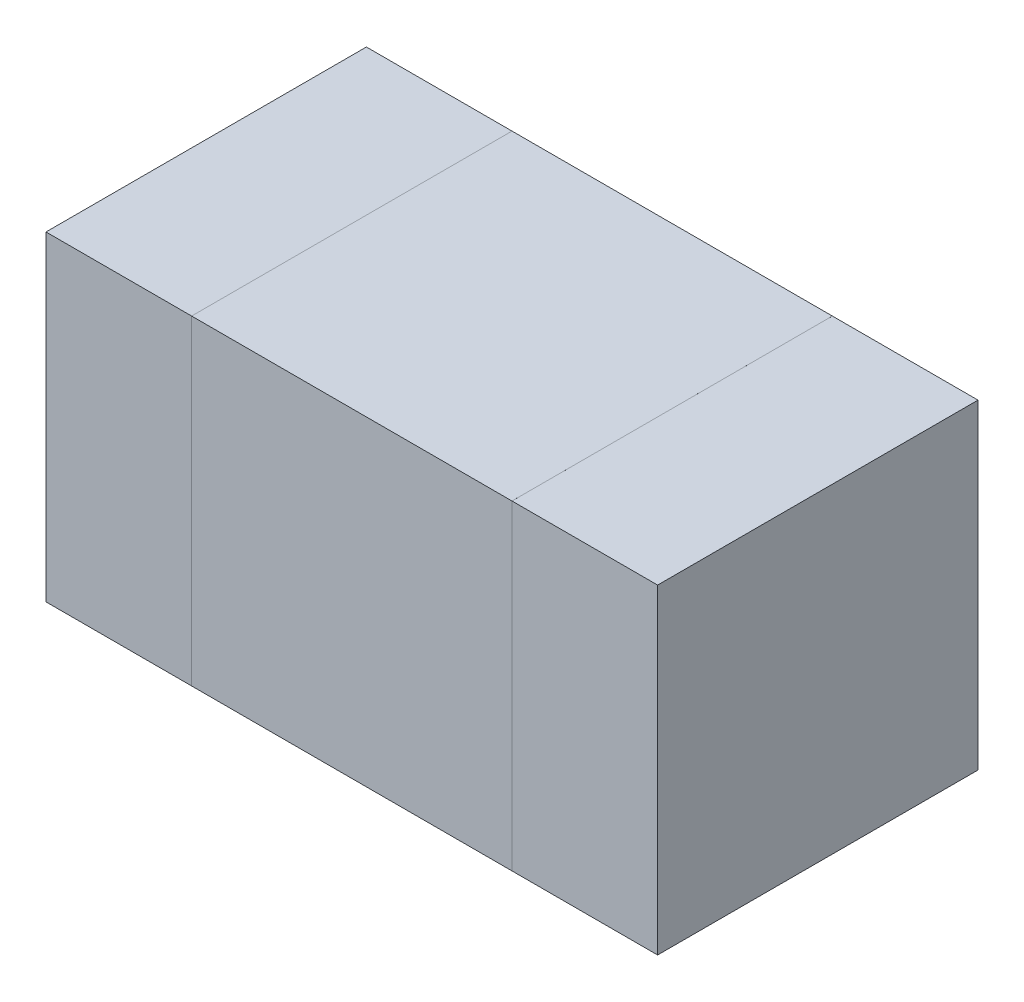
ISO-10303-21;
HEADER;
FILE_DESCRIPTION(('STEP AP214'),'2;1');
FILE_NAME('part.step','',(''),(''),'','','');
FILE_SCHEMA(('AUTOMOTIVE_DESIGN { 1 0 10303 214 1 1 1 1 }'));
ENDSEC;
DATA;
#1=APPLICATION_CONTEXT('core data for automotive mechanical design processes');
#2=APPLICATION_PROTOCOL_DEFINITION('international standard','automotive_design',2000,#1);
#3=PRODUCT_CONTEXT('',#1,'mechanical');
#4=PRODUCT('Part','Part','',(#3));
#5=PRODUCT_RELATED_PRODUCT_CATEGORY('part','',(#4));
#6=PRODUCT_DEFINITION_FORMATION('','',#4);
#7=PRODUCT_DEFINITION_CONTEXT('part definition',#1,'design');
#8=PRODUCT_DEFINITION('design','',#6,#7);
#9=PRODUCT_DEFINITION_SHAPE('','',#8);
#10=(LENGTH_UNIT() NAMED_UNIT(*) SI_UNIT(.MILLI.,.METRE.));
#11=(NAMED_UNIT(*) PLANE_ANGLE_UNIT() SI_UNIT($,.RADIAN.));
#12=(NAMED_UNIT(*) SI_UNIT($,.STERADIAN.) SOLID_ANGLE_UNIT());
#13=UNCERTAINTY_MEASURE_WITH_UNIT(LENGTH_MEASURE(1.E-05),#10,'distance_accuracy_value','');
#14=(GEOMETRIC_REPRESENTATION_CONTEXT(3) GLOBAL_UNCERTAINTY_ASSIGNED_CONTEXT((#13)) GLOBAL_UNIT_ASSIGNED_CONTEXT((#10,
#11,#12)) REPRESENTATION_CONTEXT('',''));
#15=CARTESIAN_POINT('',(0.,0.,0.));
#16=DIRECTION('',(0.,0.,1.));
#17=DIRECTION('',(1.,0.,0.));
#18=AXIS2_PLACEMENT_3D('',#15,#16,#17);
#19=CARTESIAN_POINT('',(1.63999285418,9.184994368437,0.32999934));
#20=DIRECTION('',(0.,0.,-1.));
#21=DIRECTION('',(0.,-1.,0.));
#22=AXIS2_PLACEMENT_3D('',#19,#20,#21);
#23=PLANE('',#22);
#24=DIRECTION('',(0.,1.,0.));
#25=VECTOR('',#24,1.);
#26=CARTESIAN_POINT('',(1.63999285418,9.184994368437,0.32999934));
#27=LINE('',#26,#25);
#28=CARTESIAN_POINT('',(1.63999285418,9.184994368437,0.32999934));
#29=VERTEX_POINT('',#28);
#30=CARTESIAN_POINT('',(1.63999285418,9.514996248437,0.32999934));
#31=VERTEX_POINT('',#30);
#32=EDGE_CURVE('P0_E98',#29,#31,#27,.T.);
#33=ORIENTED_EDGE('',*,*,#32,.T.);
#34=DIRECTION('',(-1.,0.,0.));
#35=VECTOR('',#34,1.);
#36=CARTESIAN_POINT('',(1.63999285418,9.514996248437,0.32999934));
#37=LINE('',#36,#35);
#38=CARTESIAN_POINT('',(1.30999351418,9.514996248437,0.32999934));
#39=VERTEX_POINT('',#38);
#40=EDGE_CURVE('P0_E78',#31,#39,#37,.T.);
#41=ORIENTED_EDGE('',*,*,#40,.T.);
#42=DIRECTION('',(0.,-1.,0.));
#43=VECTOR('',#42,1.);
#44=CARTESIAN_POINT('',(1.30999351418,9.514996248437,0.32999934));
#45=LINE('',#44,#43);
#46=CARTESIAN_POINT('',(1.30999351418,9.184994368437,0.32999934));
#47=VERTEX_POINT('',#46);
#48=EDGE_CURVE('P0_E83',#39,#47,#45,.T.);
#49=ORIENTED_EDGE('',*,*,#48,.T.);
#50=DIRECTION('',(1.,0.,0.));
#51=VECTOR('',#50,1.);
#52=CARTESIAN_POINT('',(1.30999351418,9.184994368437,0.32999934));
#53=LINE('',#52,#51);
#54=EDGE_CURVE('P0_E11',#47,#29,#53,.T.);
#55=ORIENTED_EDGE('',*,*,#54,.T.);
#56=EDGE_LOOP('',(#33,#41,#49,#55));
#57=FACE_BOUND('',#56,.T.);
#58=ADVANCED_FACE('P0_F17',(#57),#23,.F.);
#59=CARTESIAN_POINT('',(1.63999285418,9.184994368437,0.));
#60=DIRECTION('',(0.,0.,-1.));
#61=DIRECTION('',(0.,-1.,0.));
#62=AXIS2_PLACEMENT_3D('',#59,#60,#61);
#63=PLANE('',#62);
#64=DIRECTION('',(1.,0.,0.));
#65=VECTOR('',#64,1.);
#66=CARTESIAN_POINT('',(1.30999351418,9.184994368437,0.));
#67=LINE('',#66,#65);
#68=CARTESIAN_POINT('',(1.30999351418,9.184994368437,0.));
#69=VERTEX_POINT('',#68);
#70=CARTESIAN_POINT('',(1.63999285418,9.184994368437,0.));
#71=VERTEX_POINT('',#70);
#72=EDGE_CURVE('P0_E20',#69,#71,#67,.T.);
#73=ORIENTED_EDGE('',*,*,#72,.F.);
#74=DIRECTION('',(0.,-1.,0.));
#75=VECTOR('',#74,1.);
#76=CARTESIAN_POINT('',(1.30999351418,9.514996248437,0.));
#77=LINE('',#76,#75);
#78=CARTESIAN_POINT('',(1.30999351418,9.514996248437,0.));
#79=VERTEX_POINT('',#78);
#80=EDGE_CURVE('P0_E68',#79,#69,#77,.T.);
#81=ORIENTED_EDGE('',*,*,#80,.F.);
#82=DIRECTION('',(-1.,0.,0.));
#83=VECTOR('',#82,1.);
#84=CARTESIAN_POINT('',(1.63999285418,9.514996248437,0.));
#85=LINE('',#84,#83);
#86=CARTESIAN_POINT('',(1.63999285418,9.514996248437,0.));
#87=VERTEX_POINT('',#86);
#88=EDGE_CURVE('P0_E72',#87,#79,#85,.T.);
#89=ORIENTED_EDGE('',*,*,#88,.F.);
#90=DIRECTION('',(0.,1.,0.));
#91=VECTOR('',#90,1.);
#92=CARTESIAN_POINT('',(1.63999285418,9.184994368437,0.));
#93=LINE('',#92,#91);
#94=EDGE_CURVE('P0_E115',#71,#87,#93,.T.);
#95=ORIENTED_EDGE('',*,*,#94,.F.);
#96=EDGE_LOOP('',(#73,#81,#89,#95));
#97=FACE_BOUND('',#96,.T.);
#98=ADVANCED_FACE('P0_F70',(#97),#63,.T.);
#99=CARTESIAN_POINT('',(1.30999351418,9.184994368437,0.));
#100=DIRECTION('',(0.,1.,0.));
#101=DIRECTION('',(1.,0.,0.));
#102=AXIS2_PLACEMENT_3D('',#99,#100,#101);
#103=PLANE('',#102);
#104=ORIENTED_EDGE('',*,*,#72,.T.);
#105=DIRECTION('',(0.,0.,1.));
#106=VECTOR('',#105,1.);
#107=CARTESIAN_POINT('',(1.63999285418,9.184994368437,0.));
#108=LINE('',#107,#106);
#109=EDGE_CURVE('P0_E93',#71,#29,#108,.T.);
#110=ORIENTED_EDGE('',*,*,#109,.T.);
#111=ORIENTED_EDGE('',*,*,#54,.F.);
#112=DIRECTION('',(0.,0.,1.));
#113=VECTOR('',#112,1.);
#114=CARTESIAN_POINT('',(1.30999351418,9.184994368437,0.));
#115=LINE('',#114,#113);
#116=EDGE_CURVE('P0_E77',#69,#47,#115,.T.);
#117=ORIENTED_EDGE('',*,*,#116,.F.);
#118=EDGE_LOOP('',(#104,#110,#111,#117));
#119=FACE_BOUND('',#118,.T.);
#120=ADVANCED_FACE('P0_F111',(#119),#103,.F.);
#121=CARTESIAN_POINT('',(1.30999351418,9.514996248437,0.));
#122=DIRECTION('',(1.,0.,0.));
#123=DIRECTION('',(0.,1.,0.));
#124=AXIS2_PLACEMENT_3D('',#121,#122,#123);
#125=PLANE('',#124);
#126=ORIENTED_EDGE('',*,*,#80,.T.);
#127=ORIENTED_EDGE('',*,*,#116,.T.);
#128=ORIENTED_EDGE('',*,*,#48,.F.);
#129=DIRECTION('',(0.,0.,1.));
#130=VECTOR('',#129,1.);
#131=CARTESIAN_POINT('',(1.30999351418,9.514996248437,0.));
#132=LINE('',#131,#130);
#133=EDGE_CURVE('P0_E81',#79,#39,#132,.T.);
#134=ORIENTED_EDGE('',*,*,#133,.F.);
#135=EDGE_LOOP('',(#126,#127,#128,#134));
#136=FACE_BOUND('',#135,.T.);
#137=ADVANCED_FACE('P0_F82',(#136),#125,.F.);
#138=CARTESIAN_POINT('',(1.63999285418,9.514996248437,0.));
#139=DIRECTION('',(0.,-1.,0.));
#140=DIRECTION('',(0.,0.,-1.));
#141=AXIS2_PLACEMENT_3D('',#138,#139,#140);
#142=PLANE('',#141);
#143=ORIENTED_EDGE('',*,*,#88,.T.);
#144=ORIENTED_EDGE('',*,*,#133,.T.);
#145=ORIENTED_EDGE('',*,*,#40,.F.);
#146=DIRECTION('',(0.,0.,1.));
#147=VECTOR('',#146,1.);
#148=CARTESIAN_POINT('',(1.63999285418,9.514996248437,0.));
#149=LINE('',#148,#147);
#150=EDGE_CURVE('P0_E90',#87,#31,#149,.T.);
#151=ORIENTED_EDGE('',*,*,#150,.F.);
#152=EDGE_LOOP('',(#143,#144,#145,#151));
#153=FACE_BOUND('',#152,.T.);
#154=ADVANCED_FACE('P0_F88',(#153),#142,.F.);
#155=CARTESIAN_POINT('',(1.63999285418,9.184994368437,0.));
#156=DIRECTION('',(-1.,0.,0.));
#157=DIRECTION('',(0.,0.,1.));
#158=AXIS2_PLACEMENT_3D('',#155,#156,#157);
#159=PLANE('',#158);
#160=ORIENTED_EDGE('',*,*,#94,.T.);
#161=ORIENTED_EDGE('',*,*,#150,.T.);
#162=ORIENTED_EDGE('',*,*,#32,.F.);
#163=ORIENTED_EDGE('',*,*,#109,.F.);
#164=EDGE_LOOP('',(#160,#161,#162,#163));
#165=FACE_BOUND('',#164,.T.);
#166=ADVANCED_FACE('P0_F114',(#165),#159,.F.);
#167=CLOSED_SHELL('',(#58,#98,#120,#137,#154,#166));
#168=MANIFOLD_SOLID_BREP('P0_B1',#167);
#169=CARTESIAN_POINT('',(1.789998527344,9.184994368437,0.32999934));
#170=DIRECTION('',(0.,0.,-1.));
#171=DIRECTION('',(0.,-1.,0.));
#172=AXIS2_PLACEMENT_3D('',#169,#170,#171);
#173=PLANE('',#172);
#174=DIRECTION('',(0.,1.,0.));
#175=VECTOR('',#174,1.);
#176=CARTESIAN_POINT('',(1.789998527344,9.184994368437,0.32999934));
#177=LINE('',#176,#175);
#178=CARTESIAN_POINT('',(1.789998527344,9.184994368437,0.32999934));
#179=VERTEX_POINT('',#178);
#180=CARTESIAN_POINT('',(1.789998527344,9.514996248437,0.32999934));
#181=VERTEX_POINT('',#180);
#182=EDGE_CURVE('P1_E81',#179,#181,#177,.T.);
#183=ORIENTED_EDGE('',*,*,#182,.T.);
#184=DIRECTION('',(-1.,0.,0.));
#185=VECTOR('',#184,1.);
#186=CARTESIAN_POINT('',(1.789998527344,9.514996248437,0.32999934));
#187=LINE('',#186,#185);
#188=CARTESIAN_POINT('',(1.639996287344,9.514996248437,0.32999934));
#189=VERTEX_POINT('',#188);
#190=EDGE_CURVE('P1_E102',#181,#189,#187,.T.);
#191=ORIENTED_EDGE('',*,*,#190,.T.);
#192=DIRECTION('',(0.,-1.,0.));
#193=VECTOR('',#192,1.);
#194=CARTESIAN_POINT('',(1.639996287344,9.514996248437,0.32999934));
#195=LINE('',#194,#193);
#196=CARTESIAN_POINT('',(1.639996287344,9.184994368437,0.32999934));
#197=VERTEX_POINT('',#196);
#198=EDGE_CURVE('P1_E74',#189,#197,#195,.T.);
#199=ORIENTED_EDGE('',*,*,#198,.T.);
#200=DIRECTION('',(1.,0.,0.));
#201=VECTOR('',#200,1.);
#202=CARTESIAN_POINT('',(1.639996287344,9.184994368437,0.32999934));
#203=LINE('',#202,#201);
#204=EDGE_CURVE('P1_E11',#197,#179,#203,.T.);
#205=ORIENTED_EDGE('',*,*,#204,.T.);
#206=EDGE_LOOP('',(#183,#191,#199,#205));
#207=FACE_BOUND('',#206,.T.);
#208=ADVANCED_FACE('P1_F17',(#207),#173,.F.);
#209=CARTESIAN_POINT('',(1.789998527344,9.184994368437,0.));
#210=DIRECTION('',(0.,0.,-1.));
#211=DIRECTION('',(0.,-1.,0.));
#212=AXIS2_PLACEMENT_3D('',#209,#210,#211);
#213=PLANE('',#212);
#214=DIRECTION('',(1.,0.,0.));
#215=VECTOR('',#214,1.);
#216=CARTESIAN_POINT('',(1.639996287344,9.184994368437,0.));
#217=LINE('',#216,#215);
#218=CARTESIAN_POINT('',(1.639996287344,9.184994368437,0.));
#219=VERTEX_POINT('',#218);
#220=CARTESIAN_POINT('',(1.789998527344,9.184994368437,0.));
#221=VERTEX_POINT('',#220);
#222=EDGE_CURVE('P1_E25',#219,#221,#217,.T.);
#223=ORIENTED_EDGE('',*,*,#222,.F.);
#224=DIRECTION('',(0.,-1.,0.));
#225=VECTOR('',#224,1.);
#226=CARTESIAN_POINT('',(1.639996287344,9.514996248437,0.));
#227=LINE('',#226,#225);
#228=CARTESIAN_POINT('',(1.639996287344,9.514996248437,0.));
#229=VERTEX_POINT('',#228);
#230=EDGE_CURVE('P1_E98',#229,#219,#227,.T.);
#231=ORIENTED_EDGE('',*,*,#230,.F.);
#232=DIRECTION('',(-1.,0.,0.));
#233=VECTOR('',#232,1.);
#234=CARTESIAN_POINT('',(1.789998527344,9.514996248437,0.));
#235=LINE('',#234,#233);
#236=CARTESIAN_POINT('',(1.789998527344,9.514996248437,0.));
#237=VERTEX_POINT('',#236);
#238=EDGE_CURVE('P1_E83',#237,#229,#235,.T.);
#239=ORIENTED_EDGE('',*,*,#238,.F.);
#240=DIRECTION('',(0.,1.,0.));
#241=VECTOR('',#240,1.);
#242=CARTESIAN_POINT('',(1.789998527344,9.184994368437,0.));
#243=LINE('',#242,#241);
#244=EDGE_CURVE('P1_E79',#221,#237,#243,.T.);
#245=ORIENTED_EDGE('',*,*,#244,.F.);
#246=EDGE_LOOP('',(#223,#231,#239,#245));
#247=FACE_BOUND('',#246,.T.);
#248=ADVANCED_FACE('P1_F85',(#247),#213,.T.);
#249=CARTESIAN_POINT('',(1.639996287344,9.184994368437,0.));
#250=DIRECTION('',(0.,1.,0.));
#251=DIRECTION('',(1.,0.,0.));
#252=AXIS2_PLACEMENT_3D('',#249,#250,#251);
#253=PLANE('',#252);
#254=ORIENTED_EDGE('',*,*,#222,.T.);
#255=DIRECTION('',(0.,0.,1.));
#256=VECTOR('',#255,1.);
#257=CARTESIAN_POINT('',(1.789998527344,9.184994368437,0.));
#258=LINE('',#257,#256);
#259=EDGE_CURVE('P1_E68',#221,#179,#258,.T.);
#260=ORIENTED_EDGE('',*,*,#259,.T.);
#261=ORIENTED_EDGE('',*,*,#204,.F.);
#262=DIRECTION('',(0.,0.,1.));
#263=VECTOR('',#262,1.);
#264=CARTESIAN_POINT('',(1.639996287344,9.184994368437,0.));
#265=LINE('',#264,#263);
#266=EDGE_CURVE('P1_E71',#219,#197,#265,.T.);
#267=ORIENTED_EDGE('',*,*,#266,.F.);
#268=EDGE_LOOP('',(#254,#260,#261,#267));
#269=FACE_BOUND('',#268,.T.);
#270=ADVANCED_FACE('P1_F67',(#269),#253,.F.);
#271=CARTESIAN_POINT('',(1.639996287344,9.514996248437,0.));
#272=DIRECTION('',(1.,0.,0.));
#273=DIRECTION('',(0.,1.,0.));
#274=AXIS2_PLACEMENT_3D('',#271,#272,#273);
#275=PLANE('',#274);
#276=ORIENTED_EDGE('',*,*,#230,.T.);
#277=ORIENTED_EDGE('',*,*,#266,.T.);
#278=ORIENTED_EDGE('',*,*,#198,.F.);
#279=DIRECTION('',(0.,0.,1.));
#280=VECTOR('',#279,1.);
#281=CARTESIAN_POINT('',(1.639996287344,9.514996248437,0.));
#282=LINE('',#281,#280);
#283=EDGE_CURVE('P1_E106',#229,#189,#282,.T.);
#284=ORIENTED_EDGE('',*,*,#283,.F.);
#285=EDGE_LOOP('',(#276,#277,#278,#284));
#286=FACE_BOUND('',#285,.T.);
#287=ADVANCED_FACE('P1_F117',(#286),#275,.F.);
#288=CARTESIAN_POINT('',(1.789998527344,9.514996248437,0.));
#289=DIRECTION('',(0.,-1.,0.));
#290=DIRECTION('',(0.,0.,-1.));
#291=AXIS2_PLACEMENT_3D('',#288,#289,#290);
#292=PLANE('',#291);
#293=ORIENTED_EDGE('',*,*,#238,.T.);
#294=ORIENTED_EDGE('',*,*,#283,.T.);
#295=ORIENTED_EDGE('',*,*,#190,.F.);
#296=DIRECTION('',(0.,0.,1.));
#297=VECTOR('',#296,1.);
#298=CARTESIAN_POINT('',(1.789998527344,9.514996248437,0.));
#299=LINE('',#298,#297);
#300=EDGE_CURVE('P1_E89',#237,#181,#299,.T.);
#301=ORIENTED_EDGE('',*,*,#300,.F.);
#302=EDGE_LOOP('',(#293,#294,#295,#301));
#303=FACE_BOUND('',#302,.T.);
#304=ADVANCED_FACE('P1_F119',(#303),#292,.F.);
#305=CARTESIAN_POINT('',(1.789998527344,9.184994368437,0.));
#306=DIRECTION('',(-1.,0.,0.));
#307=DIRECTION('',(0.,0.,1.));
#308=AXIS2_PLACEMENT_3D('',#305,#306,#307);
#309=PLANE('',#308);
#310=ORIENTED_EDGE('',*,*,#244,.T.);
#311=ORIENTED_EDGE('',*,*,#300,.T.);
#312=ORIENTED_EDGE('',*,*,#182,.F.);
#313=ORIENTED_EDGE('',*,*,#259,.F.);
#314=EDGE_LOOP('',(#310,#311,#312,#313));
#315=FACE_BOUND('',#314,.T.);
#316=ADVANCED_FACE('P1_F77',(#315),#309,.F.);
#317=CLOSED_SHELL('',(#208,#248,#270,#287,#304,#316));
#318=MANIFOLD_SOLID_BREP('P1_B1',#317);
#319=CARTESIAN_POINT('',(1.310002799805,9.184994368437,0.32999934));
#320=DIRECTION('',(0.,0.,-1.));
#321=DIRECTION('',(0.,-1.,0.));
#322=AXIS2_PLACEMENT_3D('',#319,#320,#321);
#323=PLANE('',#322);
#324=DIRECTION('',(0.,1.,0.));
#325=VECTOR('',#324,1.);
#326=CARTESIAN_POINT('',(1.310002799805,9.184994368437,0.32999934));
#327=LINE('',#326,#325);
#328=CARTESIAN_POINT('',(1.310002799805,9.184994368437,0.32999934));
#329=VERTEX_POINT('',#328);
#330=CARTESIAN_POINT('',(1.310002799805,9.514996248437,0.32999934));
#331=VERTEX_POINT('',#330);
#332=EDGE_CURVE('P2_E81',#329,#331,#327,.T.);
#333=ORIENTED_EDGE('',*,*,#332,.T.);
#334=DIRECTION('',(-1.,0.,0.));
#335=VECTOR('',#334,1.);
#336=CARTESIAN_POINT('',(1.310002799805,9.514996248437,0.32999934));
#337=LINE('',#336,#335);
#338=CARTESIAN_POINT('',(1.160000559805,9.514996248437,0.32999934));
#339=VERTEX_POINT('',#338);
#340=EDGE_CURVE('P2_E106',#331,#339,#337,.T.);
#341=ORIENTED_EDGE('',*,*,#340,.T.);
#342=DIRECTION('',(0.,-1.,0.));
#343=VECTOR('',#342,1.);
#344=CARTESIAN_POINT('',(1.160000559805,9.514996248437,0.32999934));
#345=LINE('',#344,#343);
#346=CARTESIAN_POINT('',(1.160000559805,9.184994368437,0.32999934));
#347=VERTEX_POINT('',#346);
#348=EDGE_CURVE('P2_E74',#339,#347,#345,.T.);
#349=ORIENTED_EDGE('',*,*,#348,.T.);
#350=DIRECTION('',(1.,0.,0.));
#351=VECTOR('',#350,1.);
#352=CARTESIAN_POINT('',(1.160000559805,9.184994368437,0.32999934));
#353=LINE('',#352,#351);
#354=EDGE_CURVE('P2_E11',#347,#329,#353,.T.);
#355=ORIENTED_EDGE('',*,*,#354,.T.);
#356=EDGE_LOOP('',(#333,#341,#349,#355));
#357=FACE_BOUND('',#356,.T.);
#358=ADVANCED_FACE('P2_F17',(#357),#323,.F.);
#359=CARTESIAN_POINT('',(1.310002799805,9.184994368437,0.));
#360=DIRECTION('',(0.,0.,-1.));
#361=DIRECTION('',(0.,-1.,0.));
#362=AXIS2_PLACEMENT_3D('',#359,#360,#361);
#363=PLANE('',#362);
#364=DIRECTION('',(1.,0.,0.));
#365=VECTOR('',#364,1.);
#366=CARTESIAN_POINT('',(1.160000559805,9.184994368437,0.));
#367=LINE('',#366,#365);
#368=CARTESIAN_POINT('',(1.160000559805,9.184994368437,0.));
#369=VERTEX_POINT('',#368);
#370=CARTESIAN_POINT('',(1.310002799805,9.184994368437,0.));
#371=VERTEX_POINT('',#370);
#372=EDGE_CURVE('P2_E20',#369,#371,#367,.T.);
#373=ORIENTED_EDGE('',*,*,#372,.F.);
#374=DIRECTION('',(0.,-1.,0.));
#375=VECTOR('',#374,1.);
#376=CARTESIAN_POINT('',(1.160000559805,9.514996248437,0.));
#377=LINE('',#376,#375);
#378=CARTESIAN_POINT('',(1.160000559805,9.514996248437,0.));
#379=VERTEX_POINT('',#378);
#380=EDGE_CURVE('P2_E96',#379,#369,#377,.T.);
#381=ORIENTED_EDGE('',*,*,#380,.F.);
#382=DIRECTION('',(-1.,0.,0.));
#383=VECTOR('',#382,1.);
#384=CARTESIAN_POINT('',(1.310002799805,9.514996248437,0.));
#385=LINE('',#384,#383);
#386=CARTESIAN_POINT('',(1.310002799805,9.514996248437,0.));
#387=VERTEX_POINT('',#386);
#388=EDGE_CURVE('P2_E83',#387,#379,#385,.T.);
#389=ORIENTED_EDGE('',*,*,#388,.F.);
#390=DIRECTION('',(0.,1.,0.));
#391=VECTOR('',#390,1.);
#392=CARTESIAN_POINT('',(1.310002799805,9.184994368437,0.));
#393=LINE('',#392,#391);
#394=EDGE_CURVE('P2_E79',#371,#387,#393,.T.);
#395=ORIENTED_EDGE('',*,*,#394,.F.);
#396=EDGE_LOOP('',(#373,#381,#389,#395));
#397=FACE_BOUND('',#396,.T.);
#398=ADVANCED_FACE('P2_F85',(#397),#363,.T.);
#399=CARTESIAN_POINT('',(1.160000559805,9.184994368437,0.));
#400=DIRECTION('',(0.,1.,0.));
#401=DIRECTION('',(1.,0.,0.));
#402=AXIS2_PLACEMENT_3D('',#399,#400,#401);
#403=PLANE('',#402);
#404=ORIENTED_EDGE('',*,*,#372,.T.);
#405=DIRECTION('',(0.,0.,1.));
#406=VECTOR('',#405,1.);
#407=CARTESIAN_POINT('',(1.310002799805,9.184994368437,0.));
#408=LINE('',#407,#406);
#409=EDGE_CURVE('P2_E68',#371,#329,#408,.T.);
#410=ORIENTED_EDGE('',*,*,#409,.T.);
#411=ORIENTED_EDGE('',*,*,#354,.F.);
#412=DIRECTION('',(0.,0.,1.));
#413=VECTOR('',#412,1.);
#414=CARTESIAN_POINT('',(1.160000559805,9.184994368437,0.));
#415=LINE('',#414,#413);
#416=EDGE_CURVE('P2_E71',#369,#347,#415,.T.);
#417=ORIENTED_EDGE('',*,*,#416,.F.);
#418=EDGE_LOOP('',(#404,#410,#411,#417));
#419=FACE_BOUND('',#418,.T.);
#420=ADVANCED_FACE('P2_F67',(#419),#403,.F.);
#421=CARTESIAN_POINT('',(1.160000559805,9.514996248437,0.));
#422=DIRECTION('',(1.,0.,0.));
#423=DIRECTION('',(0.,1.,0.));
#424=AXIS2_PLACEMENT_3D('',#421,#422,#423);
#425=PLANE('',#424);
#426=ORIENTED_EDGE('',*,*,#380,.T.);
#427=ORIENTED_EDGE('',*,*,#416,.T.);
#428=ORIENTED_EDGE('',*,*,#348,.F.);
#429=DIRECTION('',(0.,0.,1.));
#430=VECTOR('',#429,1.);
#431=CARTESIAN_POINT('',(1.160000559805,9.514996248437,0.));
#432=LINE('',#431,#430);
#433=EDGE_CURVE('P2_E102',#379,#339,#432,.T.);
#434=ORIENTED_EDGE('',*,*,#433,.F.);
#435=EDGE_LOOP('',(#426,#427,#428,#434));
#436=FACE_BOUND('',#435,.T.);
#437=ADVANCED_FACE('P2_F117',(#436),#425,.F.);
#438=CARTESIAN_POINT('',(1.310002799805,9.514996248437,0.));
#439=DIRECTION('',(0.,-1.,0.));
#440=DIRECTION('',(0.,0.,-1.));
#441=AXIS2_PLACEMENT_3D('',#438,#439,#440);
#442=PLANE('',#441);
#443=ORIENTED_EDGE('',*,*,#388,.T.);
#444=ORIENTED_EDGE('',*,*,#433,.T.);
#445=ORIENTED_EDGE('',*,*,#340,.F.);
#446=DIRECTION('',(0.,0.,1.));
#447=VECTOR('',#446,1.);
#448=CARTESIAN_POINT('',(1.310002799805,9.514996248437,0.));
#449=LINE('',#448,#447);
#450=EDGE_CURVE('P2_E89',#387,#331,#449,.T.);
#451=ORIENTED_EDGE('',*,*,#450,.F.);
#452=EDGE_LOOP('',(#443,#444,#445,#451));
#453=FACE_BOUND('',#452,.T.);
#454=ADVANCED_FACE('P2_F119',(#453),#442,.F.);
#455=CARTESIAN_POINT('',(1.310002799805,9.184994368437,0.));
#456=DIRECTION('',(-1.,0.,0.));
#457=DIRECTION('',(0.,0.,1.));
#458=AXIS2_PLACEMENT_3D('',#455,#456,#457);
#459=PLANE('',#458);
#460=ORIENTED_EDGE('',*,*,#394,.T.);
#461=ORIENTED_EDGE('',*,*,#450,.T.);
#462=ORIENTED_EDGE('',*,*,#332,.F.);
#463=ORIENTED_EDGE('',*,*,#409,.F.);
#464=EDGE_LOOP('',(#460,#461,#462,#463));
#465=FACE_BOUND('',#464,.T.);
#466=ADVANCED_FACE('P2_F77',(#465),#459,.F.);
#467=CLOSED_SHELL('',(#358,#398,#420,#437,#454,#466));
#468=MANIFOLD_SOLID_BREP('P2_B1',#467);
#469=ADVANCED_BREP_SHAPE_REPRESENTATION('',(#18,#168,#318,#468),#14);
#470=SHAPE_DEFINITION_REPRESENTATION(#9,#469);
ENDSEC;
END-ISO-10303-21;
